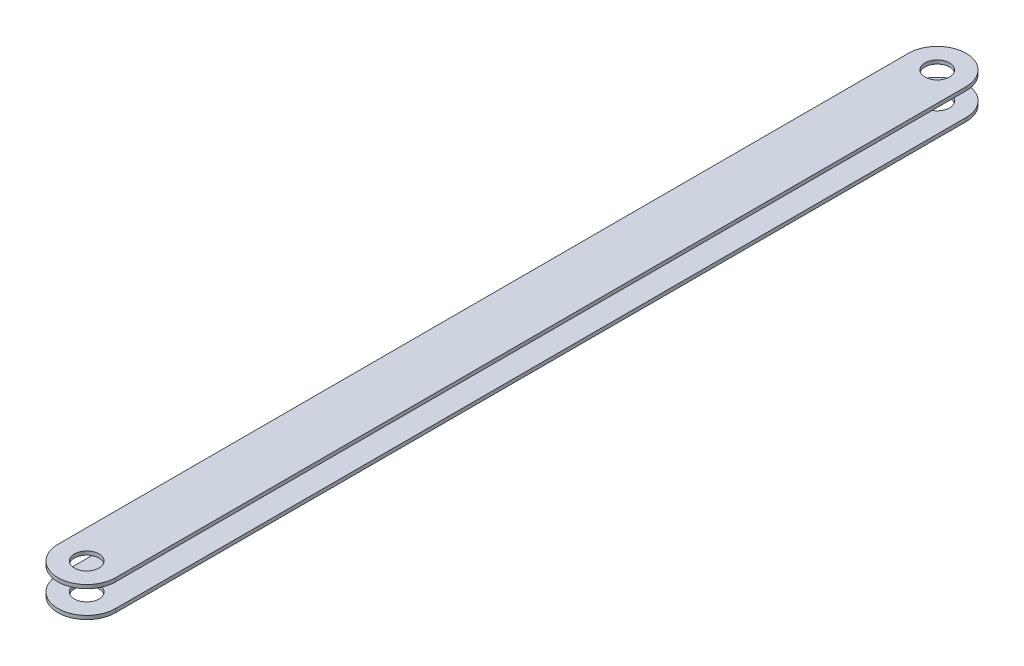
ISO-10303-21;
HEADER;
FILE_DESCRIPTION(('STEP AP214'),'2;1');
FILE_NAME('part.step','',(''),(''),'','','');
FILE_SCHEMA(('AUTOMOTIVE_DESIGN { 1 0 10303 214 1 1 1 1 }'));
ENDSEC;
DATA;
#1=APPLICATION_CONTEXT('core data for automotive mechanical design processes');
#2=APPLICATION_PROTOCOL_DEFINITION('international standard','automotive_design',2000,#1);
#3=PRODUCT_CONTEXT('',#1,'mechanical');
#4=PRODUCT('Part','Part','',(#3));
#5=PRODUCT_RELATED_PRODUCT_CATEGORY('part','',(#4));
#6=PRODUCT_DEFINITION_FORMATION('','',#4);
#7=PRODUCT_DEFINITION_CONTEXT('part definition',#1,'design');
#8=PRODUCT_DEFINITION('design','',#6,#7);
#9=PRODUCT_DEFINITION_SHAPE('','',#8);
#10=(LENGTH_UNIT() NAMED_UNIT(*) SI_UNIT(.MILLI.,.METRE.));
#11=(NAMED_UNIT(*) PLANE_ANGLE_UNIT() SI_UNIT($,.RADIAN.));
#12=(NAMED_UNIT(*) SI_UNIT($,.STERADIAN.) SOLID_ANGLE_UNIT());
#13=UNCERTAINTY_MEASURE_WITH_UNIT(LENGTH_MEASURE(1.E-05),#10,'distance_accuracy_value','');
#14=(GEOMETRIC_REPRESENTATION_CONTEXT(3) GLOBAL_UNCERTAINTY_ASSIGNED_CONTEXT((#13)) GLOBAL_UNIT_ASSIGNED_CONTEXT((#10,
#11,#12)) REPRESENTATION_CONTEXT('',''));
#15=CARTESIAN_POINT('',(0.,0.,0.));
#16=DIRECTION('',(0.,0.,1.));
#17=DIRECTION('',(1.,0.,0.));
#18=AXIS2_PLACEMENT_3D('',#15,#16,#17);
#19=CARTESIAN_POINT('',(-0.6,0.,298.999999999999));
#20=DIRECTION('',(0.999999999999999,0.,0.));
#21=DIRECTION('',(0.,0.,-0.999999999999999));
#22=AXIS2_PLACEMENT_3D('',#19,#20,#21);
#23=PLANE('',#22);
#24=DIRECTION('',(0.,1.,0.));
#25=VECTOR('',#24,1.);
#26=CARTESIAN_POINT('',(-0.6,0.,278.999999999999));
#27=LINE('',#26,#25);
#28=CARTESIAN_POINT('',(-0.599999999999998,-3.80000000000003,278.999999999999));
#29=VERTEX_POINT('',#28);
#30=CARTESIAN_POINT('',(-0.599999999999998,-3.46410161513777,278.999999999999));
#31=VERTEX_POINT('',#30);
#32=EDGE_CURVE('E232',#29,#31,#27,.T.);
#33=ORIENTED_EDGE('',*,*,#32,.T.);
#34=CARTESIAN_POINT('',(-0.599999999999998,-3.46410161513777,278.499999999999));
#35=DIRECTION('',(0.999999999999999,0.,0.));
#36=DIRECTION('',(0.,-1.,0.));
#37=AXIS2_PLACEMENT_3D('',#34,#35,#36);
#38=CIRCLE('',#37,0.5);
#39=CARTESIAN_POINT('',(-0.599999999999998,-2.96922995583238,278.571428571428));
#40=VERTEX_POINT('',#39);
#41=EDGE_CURVE('E516',#31,#40,#38,.F.);
#42=ORIENTED_EDGE('',*,*,#41,.T.);
#43=CARTESIAN_POINT('',(-0.6,0.,278.999999999999));
#44=DIRECTION('',(0.999999999999999,0.,0.));
#45=DIRECTION('',(0.,-1.,0.));
#46=AXIS2_PLACEMENT_3D('',#43,#44,#45);
#47=CIRCLE('',#46,3.);
#48=CARTESIAN_POINT('',(-0.6,2.96922995583238,278.571428571428));
#49=VERTEX_POINT('',#48);
#50=EDGE_CURVE('E286',#40,#49,#47,.T.);
#51=ORIENTED_EDGE('',*,*,#50,.T.);
#52=CARTESIAN_POINT('',(-0.60000000000001,3.46410161513766,278.499999999999));
#53=DIRECTION('',(0.999999999999999,0.,0.));
#54=DIRECTION('',(0.,-1.,0.));
#55=AXIS2_PLACEMENT_3D('',#52,#53,#54);
#56=CIRCLE('',#55,0.5);
#57=CARTESIAN_POINT('',(-0.60000000000001,3.46410161513766,278.999999999999));
#58=VERTEX_POINT('',#57);
#59=EDGE_CURVE('E241',#49,#58,#56,.F.);
#60=ORIENTED_EDGE('',*,*,#59,.T.);
#61=DIRECTION('',(0.,1.,0.));
#62=VECTOR('',#61,1.);
#63=CARTESIAN_POINT('',(-0.6,0.,278.999999999999));
#64=LINE('',#63,#62);
#65=CARTESIAN_POINT('',(-0.60000000000001,3.80000000000003,278.999999999999));
#66=VERTEX_POINT('',#65);
#67=EDGE_CURVE('E224',#58,#66,#64,.T.);
#68=ORIENTED_EDGE('',*,*,#67,.T.);
#69=DIRECTION('',(0.,0.,-0.999999999999999));
#70=VECTOR('',#69,1.);
#71=CARTESIAN_POINT('',(-0.60000000000001,3.79999999999991,298.999999999999));
#72=LINE('',#71,#70);
#73=CARTESIAN_POINT('',(-0.60000000000001,3.80000000000003,20.));
#74=VERTEX_POINT('',#73);
#75=EDGE_CURVE('E237',#66,#74,#72,.T.);
#76=ORIENTED_EDGE('',*,*,#75,.T.);
#77=DIRECTION('',(0.,1.,0.));
#78=VECTOR('',#77,1.);
#79=CARTESIAN_POINT('',(-0.6,0.,20.));
#80=LINE('',#79,#78);
#81=CARTESIAN_POINT('',(-0.60000000000001,3.46410161513777,20.));
#82=VERTEX_POINT('',#81);
#83=EDGE_CURVE('E309',#82,#74,#80,.T.);
#84=ORIENTED_EDGE('',*,*,#83,.F.);
#85=CARTESIAN_POINT('',(-0.60000000000001,3.46410161513777,20.5));
#86=DIRECTION('',(-0.999999999999999,0.,0.));
#87=DIRECTION('',(0.,-1.,0.));
#88=AXIS2_PLACEMENT_3D('',#85,#86,#87);
#89=CIRCLE('',#88,0.5);
#90=CARTESIAN_POINT('',(-0.6,2.96922995583238,20.4285714285714));
#91=VERTEX_POINT('',#90);
#92=EDGE_CURVE('E306',#91,#82,#89,.F.);
#93=ORIENTED_EDGE('',*,*,#92,.F.);
#94=CARTESIAN_POINT('',(-0.6,0.,20.));
#95=DIRECTION('',(-0.999999999999999,0.,0.));
#96=DIRECTION('',(0.,-1.,0.));
#97=AXIS2_PLACEMENT_3D('',#94,#95,#96);
#98=CIRCLE('',#97,3.);
#99=CARTESIAN_POINT('',(-0.600000000000009,-2.96922995583238,20.4285714285715));
#100=VERTEX_POINT('',#99);
#101=EDGE_CURVE('E303',#100,#91,#98,.T.);
#102=ORIENTED_EDGE('',*,*,#101,.F.);
#103=CARTESIAN_POINT('',(-0.600000000000009,-3.46410161513777,20.5));
#104=DIRECTION('',(-0.999999999999999,0.,0.));
#105=DIRECTION('',(0.,-1.,0.));
#106=AXIS2_PLACEMENT_3D('',#103,#104,#105);
#107=CIRCLE('',#106,0.5);
#108=CARTESIAN_POINT('',(-0.600000000000009,-3.46410161513777,20.));
#109=VERTEX_POINT('',#108);
#110=EDGE_CURVE('E300',#109,#100,#107,.F.);
#111=ORIENTED_EDGE('',*,*,#110,.F.);
#112=DIRECTION('',(0.,1.,0.));
#113=VECTOR('',#112,1.);
#114=CARTESIAN_POINT('',(-0.6,0.,20.));
#115=LINE('',#114,#113);
#116=CARTESIAN_POINT('',(-0.600000000000009,-3.80000000000003,20.));
#117=VERTEX_POINT('',#116);
#118=EDGE_CURVE('E297',#117,#109,#115,.T.);
#119=ORIENTED_EDGE('',*,*,#118,.F.);
#120=DIRECTION('',(0.,0.,-0.999999999999999));
#121=VECTOR('',#120,1.);
#122=CARTESIAN_POINT('',(-0.600000000000009,-3.80000000000003,298.999999999999));
#123=LINE('',#122,#121);
#124=EDGE_CURVE('E249',#29,#117,#123,.T.);
#125=ORIENTED_EDGE('',*,*,#124,.F.);
#126=EDGE_LOOP('',(#33,#42,#51,#60,#68,#76,#84,#93,#102,#111,#119,#125));
#127=FACE_BOUND('',#126,.T.);
#128=ADVANCED_FACE('F81',(#127),#23,.F.);
#129=CARTESIAN_POINT('',(0.599999999999991,0.,298.999999999999));
#130=DIRECTION('',(0.999999999999999,0.,0.));
#131=DIRECTION('',(0.,0.,-0.999999999999999));
#132=AXIS2_PLACEMENT_3D('',#129,#130,#131);
#133=PLANE('',#132);
#134=CARTESIAN_POINT('',(0.599999999999989,-3.46410161513777,278.499999999999));
#135=DIRECTION('',(0.999999999999999,0.,0.));
#136=DIRECTION('',(0.,0.,-0.999999999999999));
#137=AXIS2_PLACEMENT_3D('',#134,#135,#136);
#138=CIRCLE('',#137,0.5);
#139=CARTESIAN_POINT('',(0.599999999999989,-2.96922995583238,278.571428571428));
#140=VERTEX_POINT('',#139);
#141=CARTESIAN_POINT('',(0.599999999999989,-3.46410161513777,278.999999999999));
#142=VERTEX_POINT('',#141);
#143=EDGE_CURVE('E89',#140,#142,#138,.T.);
#144=ORIENTED_EDGE('',*,*,#143,.T.);
#145=DIRECTION('',(0.,-1.,0.));
#146=VECTOR('',#145,1.);
#147=CARTESIAN_POINT('',(0.6,0.,278.999999999999));
#148=LINE('',#147,#146);
#149=CARTESIAN_POINT('',(0.599999999999989,-3.80000000000003,278.999999999999));
#150=VERTEX_POINT('',#149);
#151=EDGE_CURVE('E14',#142,#150,#148,.T.);
#152=ORIENTED_EDGE('',*,*,#151,.T.);
#153=DIRECTION('',(0.,0.,-0.999999999999999));
#154=VECTOR('',#153,1.);
#155=CARTESIAN_POINT('',(0.599999999999991,-3.80000000000003,298.999999999999));
#156=LINE('',#155,#154);
#157=CARTESIAN_POINT('',(0.599999999999979,-3.80000000000003,20.));
#158=VERTEX_POINT('',#157);
#159=EDGE_CURVE('E388',#150,#158,#156,.T.);
#160=ORIENTED_EDGE('',*,*,#159,.T.);
#161=DIRECTION('',(0.,-1.,0.));
#162=VECTOR('',#161,1.);
#163=CARTESIAN_POINT('',(0.599999999999991,0.,20.));
#164=LINE('',#163,#162);
#165=CARTESIAN_POINT('',(0.599999999999979,-3.46410161513777,20.));
#166=VERTEX_POINT('',#165);
#167=EDGE_CURVE('E252',#166,#158,#164,.T.);
#168=ORIENTED_EDGE('',*,*,#167,.F.);
#169=CARTESIAN_POINT('',(0.599999999999979,-3.46410161513777,20.5));
#170=DIRECTION('',(0.999999999999999,0.,0.));
#171=DIRECTION('',(0.,0.,-0.999999999999999));
#172=AXIS2_PLACEMENT_3D('',#169,#170,#171);
#173=CIRCLE('',#172,0.5);
#174=CARTESIAN_POINT('',(0.599999999999979,-2.96922995583238,20.4285714285715));
#175=VERTEX_POINT('',#174);
#176=EDGE_CURVE('E260',#175,#166,#173,.F.);
#177=ORIENTED_EDGE('',*,*,#176,.F.);
#178=CARTESIAN_POINT('',(0.599999999999979,0.,20.));
#179=DIRECTION('',(0.999999999999999,0.,0.));
#180=DIRECTION('',(0.,0.,-0.999999999999999));
#181=AXIS2_PLACEMENT_3D('',#178,#179,#180);
#182=CIRCLE('',#181,3.);
#183=CARTESIAN_POINT('',(0.599999999999989,2.96922995583238,20.4285714285714));
#184=VERTEX_POINT('',#183);
#185=EDGE_CURVE('E262',#184,#175,#182,.T.);
#186=ORIENTED_EDGE('',*,*,#185,.F.);
#187=CARTESIAN_POINT('',(0.599999999999979,3.46410161513777,20.5));
#188=DIRECTION('',(0.999999999999999,0.,0.));
#189=DIRECTION('',(0.,0.,-0.999999999999999));
#190=AXIS2_PLACEMENT_3D('',#187,#188,#189);
#191=CIRCLE('',#190,0.5);
#192=CARTESIAN_POINT('',(0.599999999999979,3.46410161513777,20.));
#193=VERTEX_POINT('',#192);
#194=EDGE_CURVE('E264',#193,#184,#191,.F.);
#195=ORIENTED_EDGE('',*,*,#194,.F.);
#196=DIRECTION('',(0.,-1.,0.));
#197=VECTOR('',#196,1.);
#198=CARTESIAN_POINT('',(0.599999999999991,0.,20.));
#199=LINE('',#198,#197);
#200=CARTESIAN_POINT('',(0.599999999999979,3.80000000000003,20.));
#201=VERTEX_POINT('',#200);
#202=EDGE_CURVE('E313',#201,#193,#199,.T.);
#203=ORIENTED_EDGE('',*,*,#202,.F.);
#204=DIRECTION('',(0.,0.,-0.999999999999999));
#205=VECTOR('',#204,1.);
#206=CARTESIAN_POINT('',(0.599999999999989,3.79999999999991,298.999999999999));
#207=LINE('',#206,#205);
#208=CARTESIAN_POINT('',(0.599999999999979,3.80000000000003,278.999999999999));
#209=VERTEX_POINT('',#208);
#210=EDGE_CURVE('E386',#209,#201,#207,.T.);
#211=ORIENTED_EDGE('',*,*,#210,.F.);
#212=DIRECTION('',(0.,-1.,0.));
#213=VECTOR('',#212,1.);
#214=CARTESIAN_POINT('',(0.6,0.,278.999999999999));
#215=LINE('',#214,#213);
#216=CARTESIAN_POINT('',(0.599999999999979,3.46410161513766,278.999999999999));
#217=VERTEX_POINT('',#216);
#218=EDGE_CURVE('E227',#209,#217,#215,.T.);
#219=ORIENTED_EDGE('',*,*,#218,.T.);
#220=CARTESIAN_POINT('',(0.599999999999979,3.46410161513766,278.499999999999));
#221=DIRECTION('',(0.999999999999999,0.,0.));
#222=DIRECTION('',(0.,0.,-0.999999999999999));
#223=AXIS2_PLACEMENT_3D('',#220,#221,#222);
#224=CIRCLE('',#223,0.5);
#225=CARTESIAN_POINT('',(0.599999999999989,2.96922995583238,278.571428571428));
#226=VERTEX_POINT('',#225);
#227=EDGE_CURVE('E266',#217,#226,#224,.T.);
#228=ORIENTED_EDGE('',*,*,#227,.T.);
#229=CARTESIAN_POINT('',(0.599999999999989,0.,278.999999999999));
#230=DIRECTION('',(0.999999999999999,0.,0.));
#231=DIRECTION('',(0.,0.,-0.999999999999999));
#232=AXIS2_PLACEMENT_3D('',#229,#230,#231);
#233=CIRCLE('',#232,3.);
#234=EDGE_CURVE('E269',#226,#140,#233,.F.);
#235=ORIENTED_EDGE('',*,*,#234,.T.);
#236=EDGE_LOOP('',(#144,#152,#160,#168,#177,#186,#195,#203,#211,#219,#228,#235));
#237=FACE_BOUND('',#236,.T.);
#238=ADVANCED_FACE('F273',(#237),#133,.T.);
#239=CARTESIAN_POINT('',(0.,-365.,289.499999999999));
#240=DIRECTION('',(0.,1.,0.));
#241=DIRECTION('',(-0.999999999999999,0.,0.));
#242=AXIS2_PLACEMENT_3D('',#239,#240,#241);
#243=CYLINDRICAL_SURFACE('',#242,9.49999999999999);
#244=CARTESIAN_POINT('',(0.,3.80000000000003,289.499999999999));
#245=DIRECTION('',(0.,1.,0.));
#246=DIRECTION('',(0.,0.,0.999999999999999));
#247=AXIS2_PLACEMENT_3D('',#244,#245,#246);
#248=CIRCLE('',#247,9.49999999999999);
#249=CARTESIAN_POINT('',(9.49999999999997,3.80000000000003,289.499999999999));
#250=VERTEX_POINT('',#249);
#251=CARTESIAN_POINT('',(-9.49999999999997,3.80000000000003,289.499999999999));
#252=VERTEX_POINT('',#251);
#253=EDGE_CURVE('E96',#250,#252,#248,.F.);
#254=ORIENTED_EDGE('',*,*,#253,.F.);
#255=DIRECTION('',(0.,1.,0.));
#256=VECTOR('',#255,1.);
#257=CARTESIAN_POINT('',(9.49999999999996,-365.,289.499999999999));
#258=LINE('',#257,#256);
#259=CARTESIAN_POINT('',(9.49999999999997,5.,289.499999999999));
#260=VERTEX_POINT('',#259);
#261=EDGE_CURVE('E331',#250,#260,#258,.T.);
#262=ORIENTED_EDGE('',*,*,#261,.T.);
#263=CARTESIAN_POINT('',(0.,5.,289.499999999999));
#264=DIRECTION('',(0.,-1.,0.));
#265=DIRECTION('',(0.,0.,-0.999999999999999));
#266=AXIS2_PLACEMENT_3D('',#263,#264,#265);
#267=CIRCLE('',#266,9.49999999999999);
#268=CARTESIAN_POINT('',(-9.49999999999997,5.,289.499999999999));
#269=VERTEX_POINT('',#268);
#270=EDGE_CURVE('E328',#260,#269,#267,.T.);
#271=ORIENTED_EDGE('',*,*,#270,.T.);
#272=DIRECTION('',(0.,1.,0.));
#273=VECTOR('',#272,1.);
#274=CARTESIAN_POINT('',(-9.50000000000001,-365.,289.499999999999));
#275=LINE('',#274,#273);
#276=EDGE_CURVE('E330',#252,#269,#275,.T.);
#277=ORIENTED_EDGE('',*,*,#276,.F.);
#278=EDGE_LOOP('',(#254,#262,#271,#277));
#279=FACE_BOUND('',#278,.T.);
#280=ADVANCED_FACE('F425',(#279),#243,.T.);
#281=CARTESIAN_POINT('',(0.,-365.,289.499999999999));
#282=DIRECTION('',(0.,1.,0.));
#283=DIRECTION('',(-0.999999999999999,0.,0.));
#284=AXIS2_PLACEMENT_3D('',#281,#282,#283);
#285=CYLINDRICAL_SURFACE('',#284,4.05);
#286=CARTESIAN_POINT('',(0.,5.,289.499999999999));
#287=DIRECTION('',(0.,-1.,0.));
#288=DIRECTION('',(0.,0.,-0.999999999999999));
#289=AXIS2_PLACEMENT_3D('',#286,#287,#288);
#290=CIRCLE('',#289,4.05);
#291=CARTESIAN_POINT('',(0.,5.,285.449999999999));
#292=VERTEX_POINT('',#291);
#293=EDGE_CURVE('E325',#292,#292,#290,.T.);
#294=ORIENTED_EDGE('',*,*,#293,.F.);
#295=EDGE_LOOP('',(#294));
#296=FACE_BOUND('',#295,.T.);
#297=CARTESIAN_POINT('',(0.,3.80000000000003,289.499999999999));
#298=DIRECTION('',(0.,1.,0.));
#299=DIRECTION('',(0.,0.,0.999999999999999));
#300=AXIS2_PLACEMENT_3D('',#297,#298,#299);
#301=CIRCLE('',#300,4.05);
#302=CARTESIAN_POINT('',(0.,3.80000000000003,293.549999999999));
#303=VERTEX_POINT('',#302);
#304=EDGE_CURVE('E348',#303,#303,#301,.F.);
#305=ORIENTED_EDGE('',*,*,#304,.T.);
#306=EDGE_LOOP('',(#305));
#307=FACE_BOUND('',#306,.T.);
#308=ADVANCED_FACE('F433',(#296,#307),#285,.F.);
#309=CARTESIAN_POINT('',(0.,-365.,9.50000000000006));
#310=DIRECTION('',(0.,1.,0.));
#311=DIRECTION('',(-0.999999999999999,0.,0.));
#312=AXIS2_PLACEMENT_3D('',#309,#310,#311);
#313=CYLINDRICAL_SURFACE('',#312,9.49999999999999);
#314=CARTESIAN_POINT('',(0.,-3.80000000000003,9.50000000000006));
#315=DIRECTION('',(0.,1.,0.));
#316=DIRECTION('',(0.,0.,0.999999999999999));
#317=AXIS2_PLACEMENT_3D('',#314,#315,#316);
#318=CIRCLE('',#317,9.49999999999999);
#319=CARTESIAN_POINT('',(9.49999999999998,-3.80000000000069,9.50000000000006));
#320=VERTEX_POINT('',#319);
#321=CARTESIAN_POINT('',(-9.49999999999999,-3.80000000000003,9.50000000000006));
#322=VERTEX_POINT('',#321);
#323=EDGE_CURVE('E367',#320,#322,#318,.T.);
#324=ORIENTED_EDGE('',*,*,#323,.F.);
#325=DIRECTION('',(0.,1.,0.));
#326=VECTOR('',#325,1.);
#327=CARTESIAN_POINT('',(9.49999999999996,-365.,9.50000000000006));
#328=LINE('',#327,#326);
#329=CARTESIAN_POINT('',(9.49999999999998,-5.00000000000067,9.50000000000006));
#330=VERTEX_POINT('',#329);
#331=EDGE_CURVE('E361',#330,#320,#328,.T.);
#332=ORIENTED_EDGE('',*,*,#331,.F.);
#333=CARTESIAN_POINT('',(0.,-5.00000000000012,9.50000000000006));
#334=DIRECTION('',(0.,1.,0.));
#335=DIRECTION('',(-0.999999999999999,0.,0.));
#336=AXIS2_PLACEMENT_3D('',#333,#334,#335);
#337=CIRCLE('',#336,9.49999999999999);
#338=CARTESIAN_POINT('',(-9.5,-5.,9.50000000000006));
#339=VERTEX_POINT('',#338);
#340=EDGE_CURVE('E364',#330,#339,#337,.T.);
#341=ORIENTED_EDGE('',*,*,#340,.T.);
#342=DIRECTION('',(0.,1.,0.));
#343=VECTOR('',#342,1.);
#344=CARTESIAN_POINT('',(-9.50000000000001,-365.,9.50000000000006));
#345=LINE('',#344,#343);
#346=EDGE_CURVE('E360',#339,#322,#345,.T.);
#347=ORIENTED_EDGE('',*,*,#346,.T.);
#348=EDGE_LOOP('',(#324,#332,#341,#347));
#349=FACE_BOUND('',#348,.T.);
#350=ADVANCED_FACE('F406',(#349),#313,.T.);
#351=CARTESIAN_POINT('',(0.,-365.,9.50000000000006));
#352=DIRECTION('',(0.,1.,0.));
#353=DIRECTION('',(-0.999999999999999,0.,0.));
#354=AXIS2_PLACEMENT_3D('',#351,#352,#353);
#355=CYLINDRICAL_SURFACE('',#354,4.05);
#356=CARTESIAN_POINT('',(0.,-5.00000000000012,9.50000000000006));
#357=DIRECTION('',(0.,1.,0.));
#358=DIRECTION('',(-0.999999999999999,0.,0.));
#359=AXIS2_PLACEMENT_3D('',#356,#357,#358);
#360=CIRCLE('',#359,4.05);
#361=CARTESIAN_POINT('',(-4.05,-5.00000000000012,9.50000000000006));
#362=VERTEX_POINT('',#361);
#363=EDGE_CURVE('E375',#362,#362,#360,.T.);
#364=ORIENTED_EDGE('',*,*,#363,.F.);
#365=EDGE_LOOP('',(#364));
#366=FACE_BOUND('',#365,.T.);
#367=CARTESIAN_POINT('',(0.,-3.80000000000003,9.50000000000006));
#368=DIRECTION('',(0.,1.,0.));
#369=DIRECTION('',(0.,0.,0.999999999999999));
#370=AXIS2_PLACEMENT_3D('',#367,#368,#369);
#371=CIRCLE('',#370,4.05);
#372=CARTESIAN_POINT('',(0.,-3.80000000000003,13.5500000000001));
#373=VERTEX_POINT('',#372);
#374=EDGE_CURVE('E378',#373,#373,#371,.T.);
#375=ORIENTED_EDGE('',*,*,#374,.T.);
#376=EDGE_LOOP('',(#375));
#377=FACE_BOUND('',#376,.T.);
#378=ADVANCED_FACE('F437',(#366,#377),#355,.F.);
#379=CARTESIAN_POINT('',(0.,-5.,298.999999999999));
#380=DIRECTION('',(0.,1.,0.));
#381=DIRECTION('',(-0.999999999999999,0.,0.));
#382=AXIS2_PLACEMENT_3D('',#379,#380,#381);
#383=PLANE('',#382);
#384=CARTESIAN_POINT('',(0.,-5.,289.499999999999));
#385=DIRECTION('',(0.,1.,0.));
#386=DIRECTION('',(-0.999999999999999,0.,0.));
#387=AXIS2_PLACEMENT_3D('',#384,#385,#386);
#388=CIRCLE('',#387,4.05);
#389=CARTESIAN_POINT('',(-4.05,-5.,289.499999999999));
#390=VERTEX_POINT('',#389);
#391=EDGE_CURVE('E345',#390,#390,#388,.F.);
#392=ORIENTED_EDGE('',*,*,#391,.F.);
#393=EDGE_LOOP('',(#392));
#394=FACE_BOUND('',#393,.T.);
#395=ORIENTED_EDGE('',*,*,#363,.T.);
#396=EDGE_LOOP('',(#395));
#397=FACE_BOUND('',#396,.T.);
#398=DIRECTION('',(0.,0.,-0.999999999999999));
#399=VECTOR('',#398,1.);
#400=CARTESIAN_POINT('',(9.49999999999998,-5.,298.999999999999));
#401=LINE('',#400,#399);
#402=CARTESIAN_POINT('',(9.49999999999998,-5.,289.499999999999));
#403=VERTEX_POINT('',#402);
#404=EDGE_CURVE('E392',#403,#330,#401,.T.);
#405=ORIENTED_EDGE('',*,*,#404,.F.);
#406=CARTESIAN_POINT('',(0.,-5.,289.499999999999));
#407=DIRECTION('',(0.,1.,0.));
#408=DIRECTION('',(-0.999999999999999,0.,0.));
#409=AXIS2_PLACEMENT_3D('',#406,#407,#408);
#410=CIRCLE('',#409,9.49999999999999);
#411=CARTESIAN_POINT('',(-9.49999999999998,-5.,289.499999999999));
#412=VERTEX_POINT('',#411);
#413=EDGE_CURVE('E336',#403,#412,#410,.F.);
#414=ORIENTED_EDGE('',*,*,#413,.T.);
#415=DIRECTION('',(0.,0.,-0.999999999999999));
#416=VECTOR('',#415,1.);
#417=CARTESIAN_POINT('',(-9.49999999999997,-5.,298.999999999999));
#418=LINE('',#417,#416);
#419=EDGE_CURVE('E394',#412,#339,#418,.T.);
#420=ORIENTED_EDGE('',*,*,#419,.T.);
#421=ORIENTED_EDGE('',*,*,#340,.F.);
#422=EDGE_LOOP('',(#405,#414,#420,#421));
#423=FACE_BOUND('',#422,.T.);
#424=ADVANCED_FACE('F418',(#394,#397,#423),#383,.F.);
#425=CARTESIAN_POINT('',(0.,-3.80000000000003,298.999999999999));
#426=DIRECTION('',(0.,1.,0.));
#427=DIRECTION('',(0.,0.,0.999999999999999));
#428=AXIS2_PLACEMENT_3D('',#425,#426,#427);
#429=PLANE('',#428);
#430=DIRECTION('',(0.,0.,-0.999999999999999));
#431=VECTOR('',#430,1.);
#432=CARTESIAN_POINT('',(9.49999999999998,-3.80000000000003,298.999999999999));
#433=LINE('',#432,#431);
#434=CARTESIAN_POINT('',(9.49999999999998,-3.80000000000003,289.499999999999));
#435=VERTEX_POINT('',#434);
#436=EDGE_CURVE('E390',#435,#320,#433,.T.);
#437=ORIENTED_EDGE('',*,*,#436,.T.);
#438=ORIENTED_EDGE('',*,*,#323,.T.);
#439=DIRECTION('',(0.,0.,-0.999999999999999));
#440=VECTOR('',#439,1.);
#441=CARTESIAN_POINT('',(-9.49999999999997,-3.80000000000003,298.999999999999));
#442=LINE('',#441,#440);
#443=CARTESIAN_POINT('',(-9.49999999999997,-3.80000000000003,289.499999999999));
#444=VERTEX_POINT('',#443);
#445=EDGE_CURVE('E254',#444,#322,#442,.T.);
#446=ORIENTED_EDGE('',*,*,#445,.F.);
#447=CARTESIAN_POINT('',(0.,-3.80000000000003,289.499999999999));
#448=DIRECTION('',(0.,1.,0.));
#449=DIRECTION('',(0.,0.,0.999999999999999));
#450=AXIS2_PLACEMENT_3D('',#447,#448,#449);
#451=CIRCLE('',#450,9.49999999999999);
#452=EDGE_CURVE('E339',#435,#444,#451,.F.);
#453=ORIENTED_EDGE('',*,*,#452,.F.);
#454=EDGE_LOOP('',(#437,#438,#446,#453));
#455=FACE_BOUND('',#454,.T.);
#456=DIRECTION('',(-0.999999999999999,0.,0.));
#457=VECTOR('',#456,1.);
#458=CARTESIAN_POINT('',(369.399999999999,-3.80000000000003,278.999999999999));
#459=LINE('',#458,#457);
#460=EDGE_CURVE('E290',#150,#29,#459,.T.);
#461=ORIENTED_EDGE('',*,*,#460,.T.);
#462=ORIENTED_EDGE('',*,*,#124,.T.);
#463=DIRECTION('',(-0.999999999999999,0.,0.));
#464=VECTOR('',#463,1.);
#465=CARTESIAN_POINT('',(369.399999999999,-3.80000000000003,20.));
#466=LINE('',#465,#464);
#467=EDGE_CURVE('E311',#158,#117,#466,.T.);
#468=ORIENTED_EDGE('',*,*,#467,.F.);
#469=ORIENTED_EDGE('',*,*,#159,.F.);
#470=EDGE_LOOP('',(#461,#462,#468,#469));
#471=FACE_BOUND('',#470,.T.);
#472=CARTESIAN_POINT('',(0.,-3.80000000000003,289.499999999999));
#473=DIRECTION('',(0.,1.,0.));
#474=DIRECTION('',(0.,0.,0.999999999999999));
#475=AXIS2_PLACEMENT_3D('',#472,#473,#474);
#476=CIRCLE('',#475,4.05);
#477=CARTESIAN_POINT('',(0.,-3.80000000000003,293.549999999999));
#478=VERTEX_POINT('',#477);
#479=EDGE_CURVE('E342',#478,#478,#476,.F.);
#480=ORIENTED_EDGE('',*,*,#479,.T.);
#481=EDGE_LOOP('',(#480));
#482=FACE_BOUND('',#481,.T.);
#483=ORIENTED_EDGE('',*,*,#374,.F.);
#484=EDGE_LOOP('',(#483));
#485=FACE_BOUND('',#484,.T.);
#486=ADVANCED_FACE('F410',(#455,#471,#482,#485),#429,.T.);
#487=CARTESIAN_POINT('',(0.,3.79999999999991,298.999999999999));
#488=DIRECTION('',(0.,1.,0.));
#489=DIRECTION('',(0.,0.,0.999999999999999));
#490=AXIS2_PLACEMENT_3D('',#487,#488,#489);
#491=PLANE('',#490);
#492=DIRECTION('',(-0.999999999999999,0.,0.));
#493=VECTOR('',#492,1.);
#494=CARTESIAN_POINT('',(369.399999999999,3.80000000000003,278.999999999999));
#495=LINE('',#494,#493);
#496=EDGE_CURVE('E220',#209,#66,#495,.T.);
#497=ORIENTED_EDGE('',*,*,#496,.F.);
#498=ORIENTED_EDGE('',*,*,#210,.T.);
#499=DIRECTION('',(-0.999999999999999,0.,0.));
#500=VECTOR('',#499,1.);
#501=CARTESIAN_POINT('',(369.399999999999,3.80000000000003,20.));
#502=LINE('',#501,#500);
#503=EDGE_CURVE('E246',#201,#74,#502,.T.);
#504=ORIENTED_EDGE('',*,*,#503,.T.);
#505=ORIENTED_EDGE('',*,*,#75,.F.);
#506=EDGE_LOOP('',(#497,#498,#504,#505));
#507=FACE_BOUND('',#506,.T.);
#508=ORIENTED_EDGE('',*,*,#304,.F.);
#509=EDGE_LOOP('',(#508));
#510=FACE_BOUND('',#509,.T.);
#511=DIRECTION('',(0.,0.,-0.999999999999999));
#512=VECTOR('',#511,1.);
#513=CARTESIAN_POINT('',(9.49999999999998,3.79999999999991,298.999999999999));
#514=LINE('',#513,#512);
#515=CARTESIAN_POINT('',(9.49999999999997,3.79999999999936,9.49999999999995));
#516=VERTEX_POINT('',#515);
#517=EDGE_CURVE('E384',#250,#516,#514,.T.);
#518=ORIENTED_EDGE('',*,*,#517,.F.);
#519=ORIENTED_EDGE('',*,*,#253,.T.);
#520=DIRECTION('',(0.,0.,-0.999999999999999));
#521=VECTOR('',#520,1.);
#522=CARTESIAN_POINT('',(-9.49999999999997,3.79999999999991,298.999999999999));
#523=LINE('',#522,#521);
#524=CARTESIAN_POINT('',(-9.49999999999999,3.80000000000003,9.49999999999995));
#525=VERTEX_POINT('',#524);
#526=EDGE_CURVE('E248',#252,#525,#523,.T.);
#527=ORIENTED_EDGE('',*,*,#526,.T.);
#528=CARTESIAN_POINT('',(0.,3.80000000000003,9.49999999999995));
#529=DIRECTION('',(0.,1.,0.));
#530=DIRECTION('',(0.,0.,0.999999999999999));
#531=AXIS2_PLACEMENT_3D('',#528,#529,#530);
#532=CIRCLE('',#531,9.49999999999999);
#533=EDGE_CURVE('E368',#516,#525,#532,.T.);
#534=ORIENTED_EDGE('',*,*,#533,.F.);
#535=EDGE_LOOP('',(#518,#519,#527,#534));
#536=FACE_BOUND('',#535,.T.);
#537=CARTESIAN_POINT('',(0.,3.80000000000003,9.49999999999995));
#538=DIRECTION('',(0.,1.,0.));
#539=DIRECTION('',(0.,0.,0.999999999999999));
#540=AXIS2_PLACEMENT_3D('',#537,#538,#539);
#541=CIRCLE('',#540,4.05);
#542=CARTESIAN_POINT('',(0.,3.80000000000003,13.5499999999999));
#543=VERTEX_POINT('',#542);
#544=EDGE_CURVE('E372',#543,#543,#541,.T.);
#545=ORIENTED_EDGE('',*,*,#544,.T.);
#546=EDGE_LOOP('',(#545));
#547=FACE_BOUND('',#546,.T.);
#548=ADVANCED_FACE('F243',(#507,#510,#536,#547),#491,.F.);
#549=CARTESIAN_POINT('',(0.,5.,298.999999999999));
#550=DIRECTION('',(0.,1.,0.));
#551=DIRECTION('',(-0.999999999999999,0.,0.));
#552=AXIS2_PLACEMENT_3D('',#549,#550,#551);
#553=PLANE('',#552);
#554=ORIENTED_EDGE('',*,*,#293,.T.);
#555=EDGE_LOOP('',(#554));
#556=FACE_BOUND('',#555,.T.);
#557=CARTESIAN_POINT('',(0.,4.99999999999989,9.49999999999995));
#558=DIRECTION('',(0.,1.,0.));
#559=DIRECTION('',(0.,0.,0.999999999999999));
#560=AXIS2_PLACEMENT_3D('',#557,#558,#559);
#561=CIRCLE('',#560,4.05);
#562=CARTESIAN_POINT('',(0.,4.99999999999989,13.5499999999999));
#563=VERTEX_POINT('',#562);
#564=EDGE_CURVE('E351',#563,#563,#561,.T.);
#565=ORIENTED_EDGE('',*,*,#564,.F.);
#566=EDGE_LOOP('',(#565));
#567=FACE_BOUND('',#566,.T.);
#568=ORIENTED_EDGE('',*,*,#270,.F.);
#569=DIRECTION('',(0.,0.,-0.999999999999999));
#570=VECTOR('',#569,1.);
#571=CARTESIAN_POINT('',(9.49999999999998,5.,298.999999999999));
#572=LINE('',#571,#570);
#573=CARTESIAN_POINT('',(9.49999999999997,4.99999999999934,9.49999999999995));
#574=VERTEX_POINT('',#573);
#575=EDGE_CURVE('E382',#260,#574,#572,.T.);
#576=ORIENTED_EDGE('',*,*,#575,.T.);
#577=CARTESIAN_POINT('',(0.,4.99999999999989,9.49999999999995));
#578=DIRECTION('',(0.,1.,0.));
#579=DIRECTION('',(0.,0.,0.999999999999999));
#580=AXIS2_PLACEMENT_3D('',#577,#578,#579);
#581=CIRCLE('',#580,9.49999999999999);
#582=CARTESIAN_POINT('',(-9.49999999999999,5.,9.49999999999995));
#583=VERTEX_POINT('',#582);
#584=EDGE_CURVE('E354',#574,#583,#581,.T.);
#585=ORIENTED_EDGE('',*,*,#584,.T.);
#586=DIRECTION('',(0.,0.,-0.999999999999999));
#587=VECTOR('',#586,1.);
#588=CARTESIAN_POINT('',(-9.49999999999997,5.,298.999999999999));
#589=LINE('',#588,#587);
#590=EDGE_CURVE('E104',#269,#583,#589,.T.);
#591=ORIENTED_EDGE('',*,*,#590,.F.);
#592=EDGE_LOOP('',(#568,#576,#585,#591));
#593=FACE_BOUND('',#592,.T.);
#594=ADVANCED_FACE('F457',(#556,#567,#593),#553,.T.);
#595=CARTESIAN_POINT('',(-9.49999999999997,0.,298.999999999999));
#596=DIRECTION('',(-0.999999999999999,0.,0.));
#597=DIRECTION('',(0.,0.,0.999999999999999));
#598=AXIS2_PLACEMENT_3D('',#595,#596,#597);
#599=PLANE('',#598);
#600=ORIENTED_EDGE('',*,*,#526,.F.);
#601=ORIENTED_EDGE('',*,*,#276,.T.);
#602=ORIENTED_EDGE('',*,*,#590,.T.);
#603=EDGE_CURVE('E358',#525,#583,#345,.T.);
#604=ORIENTED_EDGE('',*,*,#603,.F.);
#605=EDGE_LOOP('',(#600,#601,#602,#604));
#606=FACE_BOUND('',#605,.T.);
#607=ADVANCED_FACE('F83',(#606),#599,.T.);
#608=CARTESIAN_POINT('',(-9.49999999999997,0.,298.999999999999));
#609=DIRECTION('',(0.999999999999999,0.,0.));
#610=DIRECTION('',(0.,0.,-0.999999999999999));
#611=AXIS2_PLACEMENT_3D('',#608,#609,#610);
#612=PLANE('',#611);
#613=EDGE_CURVE('E334',#412,#444,#275,.T.);
#614=ORIENTED_EDGE('',*,*,#613,.T.);
#615=ORIENTED_EDGE('',*,*,#445,.T.);
#616=ORIENTED_EDGE('',*,*,#346,.F.);
#617=ORIENTED_EDGE('',*,*,#419,.F.);
#618=EDGE_LOOP('',(#614,#615,#616,#617));
#619=FACE_BOUND('',#618,.T.);
#620=ADVANCED_FACE('F400',(#619),#612,.F.);
#621=CARTESIAN_POINT('',(9.49999999999998,0.,298.999999999999));
#622=DIRECTION('',(0.999999999999999,0.,0.));
#623=DIRECTION('',(0.,1.,0.));
#624=AXIS2_PLACEMENT_3D('',#621,#622,#623);
#625=PLANE('',#624);
#626=ORIENTED_EDGE('',*,*,#436,.F.);
#627=EDGE_CURVE('E333',#403,#435,#258,.T.);
#628=ORIENTED_EDGE('',*,*,#627,.F.);
#629=ORIENTED_EDGE('',*,*,#404,.T.);
#630=ORIENTED_EDGE('',*,*,#331,.T.);
#631=EDGE_LOOP('',(#626,#628,#629,#630));
#632=FACE_BOUND('',#631,.T.);
#633=ADVANCED_FACE('F415',(#632),#625,.T.);
#634=CARTESIAN_POINT('',(9.49999999999998,0.,298.999999999999));
#635=DIRECTION('',(-0.999999999999999,0.,0.));
#636=DIRECTION('',(0.,-1.,0.));
#637=AXIS2_PLACEMENT_3D('',#634,#635,#636);
#638=PLANE('',#637);
#639=ORIENTED_EDGE('',*,*,#261,.F.);
#640=ORIENTED_EDGE('',*,*,#517,.T.);
#641=EDGE_CURVE('E357',#516,#574,#328,.T.);
#642=ORIENTED_EDGE('',*,*,#641,.T.);
#643=ORIENTED_EDGE('',*,*,#575,.F.);
#644=EDGE_LOOP('',(#639,#640,#642,#643));
#645=FACE_BOUND('',#644,.T.);
#646=ADVANCED_FACE('F452',(#645),#638,.F.);
#647=ORIENTED_EDGE('',*,*,#533,.T.);
#648=ORIENTED_EDGE('',*,*,#603,.T.);
#649=ORIENTED_EDGE('',*,*,#584,.F.);
#650=ORIENTED_EDGE('',*,*,#641,.F.);
#651=EDGE_LOOP('',(#647,#648,#649,#650));
#652=FACE_BOUND('',#651,.T.);
#653=ADVANCED_FACE('F434',(#652),#313,.T.);
#654=ORIENTED_EDGE('',*,*,#564,.T.);
#655=EDGE_LOOP('',(#654));
#656=FACE_BOUND('',#655,.T.);
#657=ORIENTED_EDGE('',*,*,#544,.F.);
#658=EDGE_LOOP('',(#657));
#659=FACE_BOUND('',#658,.T.);
#660=ADVANCED_FACE('F423',(#656,#659),#355,.F.);
#661=ORIENTED_EDGE('',*,*,#452,.T.);
#662=ORIENTED_EDGE('',*,*,#613,.F.);
#663=ORIENTED_EDGE('',*,*,#413,.F.);
#664=ORIENTED_EDGE('',*,*,#627,.T.);
#665=EDGE_LOOP('',(#661,#662,#663,#664));
#666=FACE_BOUND('',#665,.T.);
#667=ADVANCED_FACE('F420',(#666),#243,.T.);
#668=ORIENTED_EDGE('',*,*,#479,.F.);
#669=EDGE_LOOP('',(#668));
#670=FACE_BOUND('',#669,.T.);
#671=ORIENTED_EDGE('',*,*,#391,.T.);
#672=EDGE_LOOP('',(#671));
#673=FACE_BOUND('',#672,.T.);
#674=ADVANCED_FACE('F422',(#670,#673),#285,.F.);
#675=CARTESIAN_POINT('',(369.399999999999,0.,20.));
#676=DIRECTION('',(0.,0.,0.999999999999999));
#677=DIRECTION('',(0.999999999999999,0.,0.));
#678=AXIS2_PLACEMENT_3D('',#675,#676,#677);
#679=PLANE('',#678);
#680=ORIENTED_EDGE('',*,*,#167,.T.);
#681=ORIENTED_EDGE('',*,*,#467,.T.);
#682=ORIENTED_EDGE('',*,*,#118,.T.);
#683=DIRECTION('',(-0.999999999999999,0.,0.));
#684=VECTOR('',#683,1.);
#685=CARTESIAN_POINT('',(369.399999999999,-3.46410161513777,20.));
#686=LINE('',#685,#684);
#687=EDGE_CURVE('E320',#166,#109,#686,.T.);
#688=ORIENTED_EDGE('',*,*,#687,.F.);
#689=EDGE_LOOP('',(#680,#681,#682,#688));
#690=FACE_BOUND('',#689,.T.);
#691=ADVANCED_FACE('F430',(#690),#679,.F.);
#692=CARTESIAN_POINT('',(369.399999999999,-3.46410161513777,20.5000000000001));
#693=DIRECTION('',(-0.999999999999999,0.,0.));
#694=DIRECTION('',(0.,0.,0.999999999999999));
#695=AXIS2_PLACEMENT_3D('',#692,#693,#694);
#696=CYLINDRICAL_SURFACE('',#695,0.5);
#697=ORIENTED_EDGE('',*,*,#176,.T.);
#698=ORIENTED_EDGE('',*,*,#687,.T.);
#699=ORIENTED_EDGE('',*,*,#110,.T.);
#700=DIRECTION('',(-0.999999999999999,0.,0.));
#701=VECTOR('',#700,1.);
#702=CARTESIAN_POINT('',(369.399999999999,-2.96922995583238,20.4285714285715));
#703=LINE('',#702,#701);
#704=EDGE_CURVE('E318',#175,#100,#703,.T.);
#705=ORIENTED_EDGE('',*,*,#704,.F.);
#706=EDGE_LOOP('',(#697,#698,#699,#705));
#707=FACE_BOUND('',#706,.T.);
#708=ADVANCED_FACE('F482',(#707),#696,.T.);
#709=CARTESIAN_POINT('',(369.399999999999,0.,20.));
#710=DIRECTION('',(-0.999999999999999,0.,0.));
#711=DIRECTION('',(0.,0.,0.999999999999999));
#712=AXIS2_PLACEMENT_3D('',#709,#710,#711);
#713=CYLINDRICAL_SURFACE('',#712,3.);
#714=ORIENTED_EDGE('',*,*,#185,.T.);
#715=ORIENTED_EDGE('',*,*,#704,.T.);
#716=ORIENTED_EDGE('',*,*,#101,.T.);
#717=DIRECTION('',(-0.999999999999999,0.,0.));
#718=VECTOR('',#717,1.);
#719=CARTESIAN_POINT('',(369.399999999999,2.96922995583238,20.4285714285715));
#720=LINE('',#719,#718);
#721=EDGE_CURVE('E316',#184,#91,#720,.T.);
#722=ORIENTED_EDGE('',*,*,#721,.F.);
#723=EDGE_LOOP('',(#714,#715,#716,#722));
#724=FACE_BOUND('',#723,.T.);
#725=ADVANCED_FACE('F486',(#724),#713,.F.);
#726=CARTESIAN_POINT('',(369.399999999999,3.46410161513777,20.5));
#727=DIRECTION('',(-0.999999999999999,0.,0.));
#728=DIRECTION('',(0.,0.,0.999999999999999));
#729=AXIS2_PLACEMENT_3D('',#726,#727,#728);
#730=CYLINDRICAL_SURFACE('',#729,0.5);
#731=ORIENTED_EDGE('',*,*,#194,.T.);
#732=ORIENTED_EDGE('',*,*,#721,.T.);
#733=ORIENTED_EDGE('',*,*,#92,.T.);
#734=DIRECTION('',(-0.999999999999999,0.,0.));
#735=VECTOR('',#734,1.);
#736=CARTESIAN_POINT('',(369.399999999999,3.46410161513777,20.));
#737=LINE('',#736,#735);
#738=EDGE_CURVE('E314',#193,#82,#737,.T.);
#739=ORIENTED_EDGE('',*,*,#738,.F.);
#740=EDGE_LOOP('',(#731,#732,#733,#739));
#741=FACE_BOUND('',#740,.T.);
#742=ADVANCED_FACE('F490',(#741),#730,.T.);
#743=CARTESIAN_POINT('',(369.399999999999,0.,20.));
#744=DIRECTION('',(0.,0.,0.999999999999999));
#745=DIRECTION('',(0.999999999999999,0.,0.));
#746=AXIS2_PLACEMENT_3D('',#743,#744,#745);
#747=PLANE('',#746);
#748=ORIENTED_EDGE('',*,*,#202,.T.);
#749=ORIENTED_EDGE('',*,*,#738,.T.);
#750=ORIENTED_EDGE('',*,*,#83,.T.);
#751=ORIENTED_EDGE('',*,*,#503,.F.);
#752=EDGE_LOOP('',(#748,#749,#750,#751));
#753=FACE_BOUND('',#752,.T.);
#754=ADVANCED_FACE('F494',(#753),#747,.F.);
#755=CARTESIAN_POINT('',(369.399999999999,0.,278.999999999999));
#756=DIRECTION('',(0.,0.,0.999999999999999));
#757=DIRECTION('',(0.999999999999999,0.,0.));
#758=AXIS2_PLACEMENT_3D('',#755,#756,#757);
#759=PLANE('',#758);
#760=ORIENTED_EDGE('',*,*,#496,.T.);
#761=ORIENTED_EDGE('',*,*,#67,.F.);
#762=DIRECTION('',(-0.999999999999999,0.,0.));
#763=VECTOR('',#762,1.);
#764=CARTESIAN_POINT('',(369.399999999999,3.46410161513777,278.999999999999));
#765=LINE('',#764,#763);
#766=EDGE_CURVE('E231',#217,#58,#765,.T.);
#767=ORIENTED_EDGE('',*,*,#766,.F.);
#768=ORIENTED_EDGE('',*,*,#218,.F.);
#769=EDGE_LOOP('',(#760,#761,#767,#768));
#770=FACE_BOUND('',#769,.T.);
#771=ADVANCED_FACE('F222',(#770),#759,.T.);
#772=CARTESIAN_POINT('',(369.399999999999,3.46410161513777,278.499999999999));
#773=DIRECTION('',(-0.999999999999999,0.,0.));
#774=DIRECTION('',(0.,0.,0.999999999999999));
#775=AXIS2_PLACEMENT_3D('',#772,#773,#774);
#776=CYLINDRICAL_SURFACE('',#775,0.5);
#777=ORIENTED_EDGE('',*,*,#766,.T.);
#778=ORIENTED_EDGE('',*,*,#59,.F.);
#779=DIRECTION('',(-0.999999999999999,0.,0.));
#780=VECTOR('',#779,1.);
#781=CARTESIAN_POINT('',(369.399999999999,2.96922995583238,278.571428571428));
#782=LINE('',#781,#780);
#783=EDGE_CURVE('E288',#226,#49,#782,.T.);
#784=ORIENTED_EDGE('',*,*,#783,.F.);
#785=ORIENTED_EDGE('',*,*,#227,.F.);
#786=EDGE_LOOP('',(#777,#778,#784,#785));
#787=FACE_BOUND('',#786,.T.);
#788=ADVANCED_FACE('F501',(#787),#776,.T.);
#789=CARTESIAN_POINT('',(369.399999999999,0.,278.999999999999));
#790=DIRECTION('',(-0.999999999999999,0.,0.));
#791=DIRECTION('',(0.,0.,0.999999999999999));
#792=AXIS2_PLACEMENT_3D('',#789,#790,#791);
#793=CYLINDRICAL_SURFACE('',#792,3.);
#794=ORIENTED_EDGE('',*,*,#783,.T.);
#795=ORIENTED_EDGE('',*,*,#50,.F.);
#796=DIRECTION('',(-0.999999999999999,0.,0.));
#797=VECTOR('',#796,1.);
#798=CARTESIAN_POINT('',(369.399999999999,-2.96922995583238,278.571428571428));
#799=LINE('',#798,#797);
#800=EDGE_CURVE('E280',#140,#40,#799,.T.);
#801=ORIENTED_EDGE('',*,*,#800,.F.);
#802=ORIENTED_EDGE('',*,*,#234,.F.);
#803=EDGE_LOOP('',(#794,#795,#801,#802));
#804=FACE_BOUND('',#803,.T.);
#805=ADVANCED_FACE('F284',(#804),#793,.F.);
#806=CARTESIAN_POINT('',(369.399999999999,-3.46410161513777,278.499999999999));
#807=DIRECTION('',(-0.999999999999999,0.,0.));
#808=DIRECTION('',(0.,0.,0.999999999999999));
#809=AXIS2_PLACEMENT_3D('',#806,#807,#808);
#810=CYLINDRICAL_SURFACE('',#809,0.5);
#811=ORIENTED_EDGE('',*,*,#800,.T.);
#812=ORIENTED_EDGE('',*,*,#41,.F.);
#813=DIRECTION('',(-0.999999999999999,0.,0.));
#814=VECTOR('',#813,1.);
#815=CARTESIAN_POINT('',(369.399999999999,-3.46410161513777,278.999999999999));
#816=LINE('',#815,#814);
#817=EDGE_CURVE('E282',#142,#31,#816,.T.);
#818=ORIENTED_EDGE('',*,*,#817,.F.);
#819=ORIENTED_EDGE('',*,*,#143,.F.);
#820=EDGE_LOOP('',(#811,#812,#818,#819));
#821=FACE_BOUND('',#820,.T.);
#822=ADVANCED_FACE('F278',(#821),#810,.T.);
#823=CARTESIAN_POINT('',(369.399999999999,0.,278.999999999999));
#824=DIRECTION('',(0.,0.,0.999999999999999));
#825=DIRECTION('',(0.999999999999999,0.,0.));
#826=AXIS2_PLACEMENT_3D('',#823,#824,#825);
#827=PLANE('',#826);
#828=ORIENTED_EDGE('',*,*,#817,.T.);
#829=ORIENTED_EDGE('',*,*,#32,.F.);
#830=ORIENTED_EDGE('',*,*,#460,.F.);
#831=ORIENTED_EDGE('',*,*,#151,.F.);
#832=EDGE_LOOP('',(#828,#829,#830,#831));
#833=FACE_BOUND('',#832,.T.);
#834=ADVANCED_FACE('F509',(#833),#827,.T.);
#835=CLOSED_SHELL('',(#128,#238,#280,#308,#350,#378,#424,#486,#548,#594,#607,#620,#633,#646,
#653,#660,#667,#674,#691,#708,#725,#742,#754,#771,#788,#805,#822,#834));
#836=MANIFOLD_SOLID_BREP('B2',#835);
#837=ADVANCED_BREP_SHAPE_REPRESENTATION('',(#18,#836),#14);
#838=SHAPE_DEFINITION_REPRESENTATION(#9,#837);
ENDSEC;
END-ISO-10303-21;
